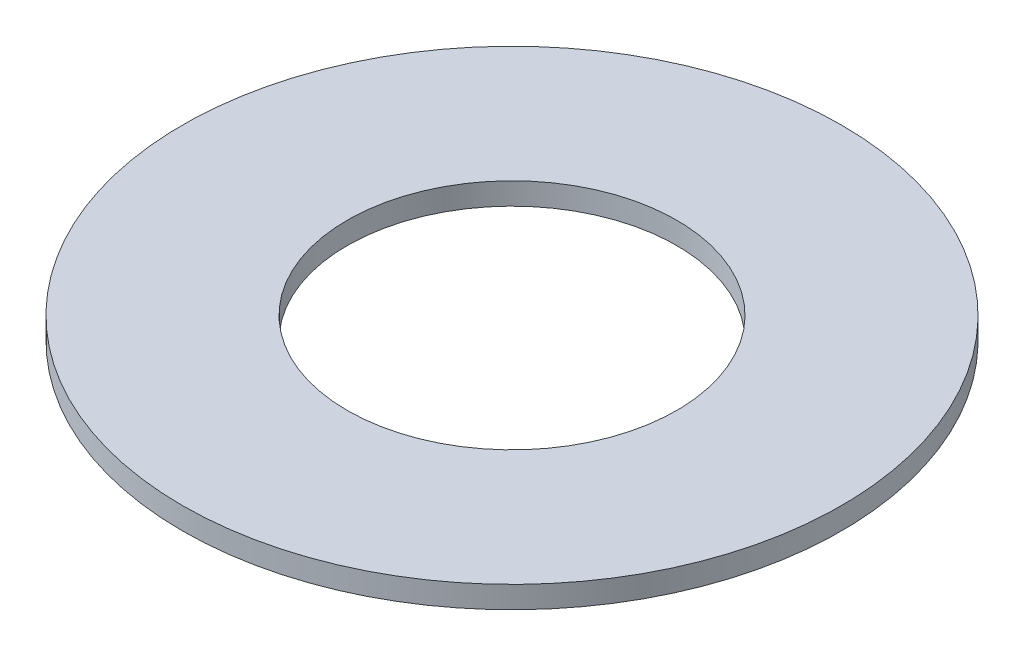
ISO-10303-21;
HEADER;
FILE_DESCRIPTION(('STEP AP214'),'2;1');
FILE_NAME('part.step','',(''),(''),'','','');
FILE_SCHEMA(('AUTOMOTIVE_DESIGN { 1 0 10303 214 1 1 1 1 }'));
ENDSEC;
DATA;
#1=APPLICATION_CONTEXT('core data for automotive mechanical design processes');
#2=APPLICATION_PROTOCOL_DEFINITION('international standard','automotive_design',2000,#1);
#3=PRODUCT_CONTEXT('',#1,'mechanical');
#4=PRODUCT('Part','Part','',(#3));
#5=PRODUCT_RELATED_PRODUCT_CATEGORY('part','',(#4));
#6=PRODUCT_DEFINITION_FORMATION('','',#4);
#7=PRODUCT_DEFINITION_CONTEXT('part definition',#1,'design');
#8=PRODUCT_DEFINITION('design','',#6,#7);
#9=PRODUCT_DEFINITION_SHAPE('','',#8);
#10=(LENGTH_UNIT() NAMED_UNIT(*) SI_UNIT(.MILLI.,.METRE.));
#11=(NAMED_UNIT(*) PLANE_ANGLE_UNIT() SI_UNIT($,.RADIAN.));
#12=(NAMED_UNIT(*) SI_UNIT($,.STERADIAN.) SOLID_ANGLE_UNIT());
#13=UNCERTAINTY_MEASURE_WITH_UNIT(LENGTH_MEASURE(1.E-05),#10,'distance_accuracy_value','');
#14=(GEOMETRIC_REPRESENTATION_CONTEXT(3) GLOBAL_UNCERTAINTY_ASSIGNED_CONTEXT((#13)) GLOBAL_UNIT_ASSIGNED_CONTEXT((#10,
#11,#12)) REPRESENTATION_CONTEXT('',''));
#15=CARTESIAN_POINT('',(0.,0.,0.));
#16=DIRECTION('',(0.,0.,1.));
#17=DIRECTION('',(1.,0.,0.));
#18=AXIS2_PLACEMENT_3D('',#15,#16,#17);
#19=CARTESIAN_POINT('',(0.,0.4,0.));
#20=DIRECTION('',(0.,1.,0.));
#21=DIRECTION('',(0.,0.,1.));
#22=AXIS2_PLACEMENT_3D('',#19,#20,#21);
#23=PLANE('',#22);
#24=CARTESIAN_POINT('',(0.,0.4,0.));
#25=DIRECTION('',(0.,1.,0.));
#26=DIRECTION('',(0.,0.,1.));
#27=AXIS2_PLACEMENT_3D('',#24,#25,#26);
#28=CIRCLE('',#27,6.);
#29=CARTESIAN_POINT('',(0.,0.4,6.));
#30=VERTEX_POINT('',#29);
#31=EDGE_CURVE('E10',#30,#30,#28,.T.);
#32=ORIENTED_EDGE('',*,*,#31,.T.);
#33=EDGE_LOOP('',(#32));
#34=FACE_BOUND('',#33,.T.);
#35=CARTESIAN_POINT('',(0.,0.4,0.));
#36=DIRECTION('',(0.,1.,0.));
#37=DIRECTION('',(0.,0.,1.));
#38=AXIS2_PLACEMENT_3D('',#35,#36,#37);
#39=CIRCLE('',#38,3.);
#40=CARTESIAN_POINT('',(0.,0.4,3.));
#41=VERTEX_POINT('',#40);
#42=EDGE_CURVE('E42',#41,#41,#39,.T.);
#43=ORIENTED_EDGE('',*,*,#42,.F.);
#44=EDGE_LOOP('',(#43));
#45=FACE_BOUND('',#44,.T.);
#46=ADVANCED_FACE('F31',(#34,#45),#23,.T.);
#47=CARTESIAN_POINT('',(0.,0.,0.));
#48=DIRECTION('',(0.,1.,0.));
#49=DIRECTION('',(0.,0.,1.));
#50=AXIS2_PLACEMENT_3D('',#47,#48,#49);
#51=PLANE('',#50);
#52=CARTESIAN_POINT('',(0.,0.,0.));
#53=DIRECTION('',(0.,1.,0.));
#54=DIRECTION('',(0.,0.,1.));
#55=AXIS2_PLACEMENT_3D('',#52,#53,#54);
#56=CIRCLE('',#55,6.);
#57=CARTESIAN_POINT('',(0.,0.,6.));
#58=VERTEX_POINT('',#57);
#59=EDGE_CURVE('E35',#58,#58,#56,.T.);
#60=ORIENTED_EDGE('',*,*,#59,.F.);
#61=EDGE_LOOP('',(#60));
#62=FACE_BOUND('',#61,.T.);
#63=CARTESIAN_POINT('',(0.,0.,0.));
#64=DIRECTION('',(0.,1.,0.));
#65=DIRECTION('',(0.,0.,1.));
#66=AXIS2_PLACEMENT_3D('',#63,#64,#65);
#67=CIRCLE('',#66,3.);
#68=CARTESIAN_POINT('',(0.,0.,3.));
#69=VERTEX_POINT('',#68);
#70=EDGE_CURVE('E44',#69,#69,#67,.T.);
#71=ORIENTED_EDGE('',*,*,#70,.T.);
#72=EDGE_LOOP('',(#71));
#73=FACE_BOUND('',#72,.T.);
#74=ADVANCED_FACE('F54',(#62,#73),#51,.F.);
#75=CARTESIAN_POINT('',(0.,0.4,0.));
#76=DIRECTION('',(0.,-1.,0.));
#77=DIRECTION('',(0.,0.,-1.));
#78=AXIS2_PLACEMENT_3D('',#75,#76,#77);
#79=CYLINDRICAL_SURFACE('',#78,6.);
#80=ORIENTED_EDGE('',*,*,#31,.F.);
#81=EDGE_LOOP('',(#80));
#82=FACE_BOUND('',#81,.T.);
#83=ORIENTED_EDGE('',*,*,#59,.T.);
#84=EDGE_LOOP('',(#83));
#85=FACE_BOUND('',#84,.T.);
#86=ADVANCED_FACE('F33',(#82,#85),#79,.T.);
#87=CARTESIAN_POINT('',(0.,0.4,0.));
#88=DIRECTION('',(0.,-1.,0.));
#89=DIRECTION('',(0.,0.,-1.));
#90=AXIS2_PLACEMENT_3D('',#87,#88,#89);
#91=CYLINDRICAL_SURFACE('',#90,3.);
#92=ORIENTED_EDGE('',*,*,#42,.T.);
#93=EDGE_LOOP('',(#92));
#94=FACE_BOUND('',#93,.T.);
#95=ORIENTED_EDGE('',*,*,#70,.F.);
#96=EDGE_LOOP('',(#95));
#97=FACE_BOUND('',#96,.T.);
#98=ADVANCED_FACE('F50',(#94,#97),#91,.F.);
#99=CLOSED_SHELL('',(#46,#74,#86,#98));
#100=MANIFOLD_SOLID_BREP('B2',#99);
#101=ADVANCED_BREP_SHAPE_REPRESENTATION('',(#18,#100),#14);
#102=SHAPE_DEFINITION_REPRESENTATION(#9,#101);
ENDSEC;
END-ISO-10303-21;
